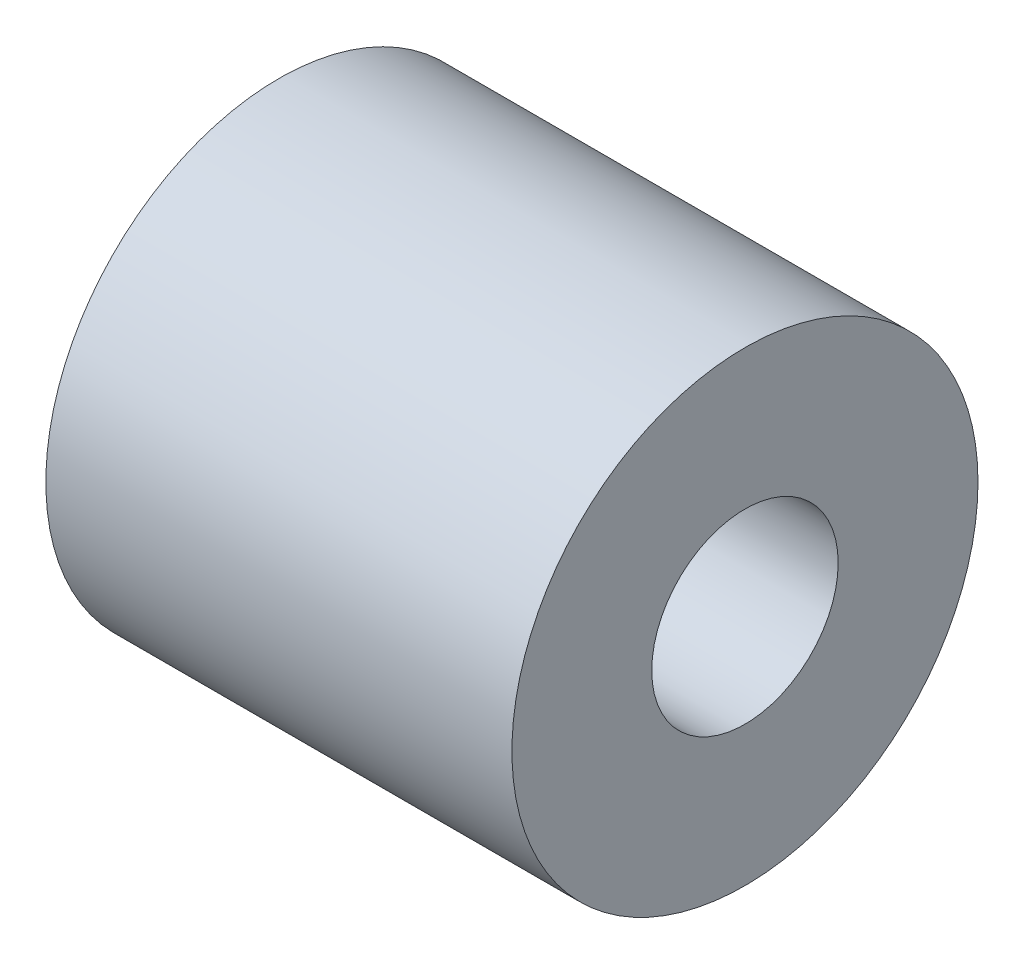
ISO-10303-21;
HEADER;
FILE_DESCRIPTION(('STEP AP214'),'2;1');
FILE_NAME('part.step','',(''),(''),'','','');
FILE_SCHEMA(('AUTOMOTIVE_DESIGN { 1 0 10303 214 1 1 1 1 }'));
ENDSEC;
DATA;
#1=APPLICATION_CONTEXT('core data for automotive mechanical design processes');
#2=APPLICATION_PROTOCOL_DEFINITION('international standard','automotive_design',2000,#1);
#3=PRODUCT_CONTEXT('',#1,'mechanical');
#4=PRODUCT('Part','Part','',(#3));
#5=PRODUCT_RELATED_PRODUCT_CATEGORY('part','',(#4));
#6=PRODUCT_DEFINITION_FORMATION('','',#4);
#7=PRODUCT_DEFINITION_CONTEXT('part definition',#1,'design');
#8=PRODUCT_DEFINITION('design','',#6,#7);
#9=PRODUCT_DEFINITION_SHAPE('','',#8);
#10=(LENGTH_UNIT() NAMED_UNIT(*) SI_UNIT(.MILLI.,.METRE.));
#11=(NAMED_UNIT(*) PLANE_ANGLE_UNIT() SI_UNIT($,.RADIAN.));
#12=(NAMED_UNIT(*) SI_UNIT($,.STERADIAN.) SOLID_ANGLE_UNIT());
#13=UNCERTAINTY_MEASURE_WITH_UNIT(LENGTH_MEASURE(1.E-05),#10,'distance_accuracy_value','');
#14=(GEOMETRIC_REPRESENTATION_CONTEXT(3) GLOBAL_UNCERTAINTY_ASSIGNED_CONTEXT((#13)) GLOBAL_UNIT_ASSIGNED_CONTEXT((#10,
#11,#12)) REPRESENTATION_CONTEXT('',''));
#15=CARTESIAN_POINT('',(0.,0.,0.));
#16=DIRECTION('',(0.,0.,1.));
#17=DIRECTION('',(1.,0.,0.));
#18=AXIS2_PLACEMENT_3D('',#15,#16,#17);
#19=CARTESIAN_POINT('',(5.,0.,0.));
#20=DIRECTION('',(1.,0.,0.));
#21=DIRECTION('',(0.,0.,-1.));
#22=AXIS2_PLACEMENT_3D('',#19,#20,#21);
#23=PLANE('',#22);
#24=CARTESIAN_POINT('',(5.,0.,0.));
#25=DIRECTION('',(1.,0.,0.));
#26=DIRECTION('',(0.,0.,-1.));
#27=AXIS2_PLACEMENT_3D('',#24,#25,#26);
#28=CIRCLE('',#27,2.5);
#29=CARTESIAN_POINT('',(5.,0.,-2.5));
#30=VERTEX_POINT('',#29);
#31=EDGE_CURVE('E10',#30,#30,#28,.T.);
#32=ORIENTED_EDGE('',*,*,#31,.T.);
#33=EDGE_LOOP('',(#32));
#34=FACE_BOUND('',#33,.T.);
#35=CARTESIAN_POINT('',(5.,0.,0.));
#36=DIRECTION('',(1.,0.,0.));
#37=DIRECTION('',(0.,0.,-1.));
#38=AXIS2_PLACEMENT_3D('',#35,#36,#37);
#39=CIRCLE('',#38,1.);
#40=CARTESIAN_POINT('',(5.,0.,-1.));
#41=VERTEX_POINT('',#40);
#42=EDGE_CURVE('E42',#41,#41,#39,.T.);
#43=ORIENTED_EDGE('',*,*,#42,.F.);
#44=EDGE_LOOP('',(#43));
#45=FACE_BOUND('',#44,.T.);
#46=ADVANCED_FACE('F31',(#34,#45),#23,.T.);
#47=CARTESIAN_POINT('',(0.,0.,0.));
#48=DIRECTION('',(1.,0.,0.));
#49=DIRECTION('',(0.,0.,-1.));
#50=AXIS2_PLACEMENT_3D('',#47,#48,#49);
#51=PLANE('',#50);
#52=CARTESIAN_POINT('',(0.,0.,0.));
#53=DIRECTION('',(1.,0.,0.));
#54=DIRECTION('',(0.,0.,-1.));
#55=AXIS2_PLACEMENT_3D('',#52,#53,#54);
#56=CIRCLE('',#55,2.5);
#57=CARTESIAN_POINT('',(0.,0.,-2.5));
#58=VERTEX_POINT('',#57);
#59=EDGE_CURVE('E35',#58,#58,#56,.T.);
#60=ORIENTED_EDGE('',*,*,#59,.F.);
#61=EDGE_LOOP('',(#60));
#62=FACE_BOUND('',#61,.T.);
#63=CARTESIAN_POINT('',(0.,0.,0.));
#64=DIRECTION('',(1.,0.,0.));
#65=DIRECTION('',(0.,0.,-1.));
#66=AXIS2_PLACEMENT_3D('',#63,#64,#65);
#67=CIRCLE('',#66,1.);
#68=CARTESIAN_POINT('',(0.,0.,-1.));
#69=VERTEX_POINT('',#68);
#70=EDGE_CURVE('E44',#69,#69,#67,.T.);
#71=ORIENTED_EDGE('',*,*,#70,.T.);
#72=EDGE_LOOP('',(#71));
#73=FACE_BOUND('',#72,.T.);
#74=ADVANCED_FACE('F54',(#62,#73),#51,.F.);
#75=CARTESIAN_POINT('',(5.,0.,0.));
#76=DIRECTION('',(-1.,0.,0.));
#77=DIRECTION('',(0.,0.,1.));
#78=AXIS2_PLACEMENT_3D('',#75,#76,#77);
#79=CYLINDRICAL_SURFACE('',#78,2.5);
#80=ORIENTED_EDGE('',*,*,#31,.F.);
#81=EDGE_LOOP('',(#80));
#82=FACE_BOUND('',#81,.T.);
#83=ORIENTED_EDGE('',*,*,#59,.T.);
#84=EDGE_LOOP('',(#83));
#85=FACE_BOUND('',#84,.T.);
#86=ADVANCED_FACE('F33',(#82,#85),#79,.T.);
#87=CARTESIAN_POINT('',(5.,0.,0.));
#88=DIRECTION('',(-1.,0.,0.));
#89=DIRECTION('',(0.,0.,1.));
#90=AXIS2_PLACEMENT_3D('',#87,#88,#89);
#91=CYLINDRICAL_SURFACE('',#90,1.);
#92=ORIENTED_EDGE('',*,*,#42,.T.);
#93=EDGE_LOOP('',(#92));
#94=FACE_BOUND('',#93,.T.);
#95=ORIENTED_EDGE('',*,*,#70,.F.);
#96=EDGE_LOOP('',(#95));
#97=FACE_BOUND('',#96,.T.);
#98=ADVANCED_FACE('F50',(#94,#97),#91,.F.);
#99=CLOSED_SHELL('',(#46,#74,#86,#98));
#100=MANIFOLD_SOLID_BREP('B2',#99);
#101=ADVANCED_BREP_SHAPE_REPRESENTATION('',(#18,#100),#14);
#102=SHAPE_DEFINITION_REPRESENTATION(#9,#101);
ENDSEC;
END-ISO-10303-21;
